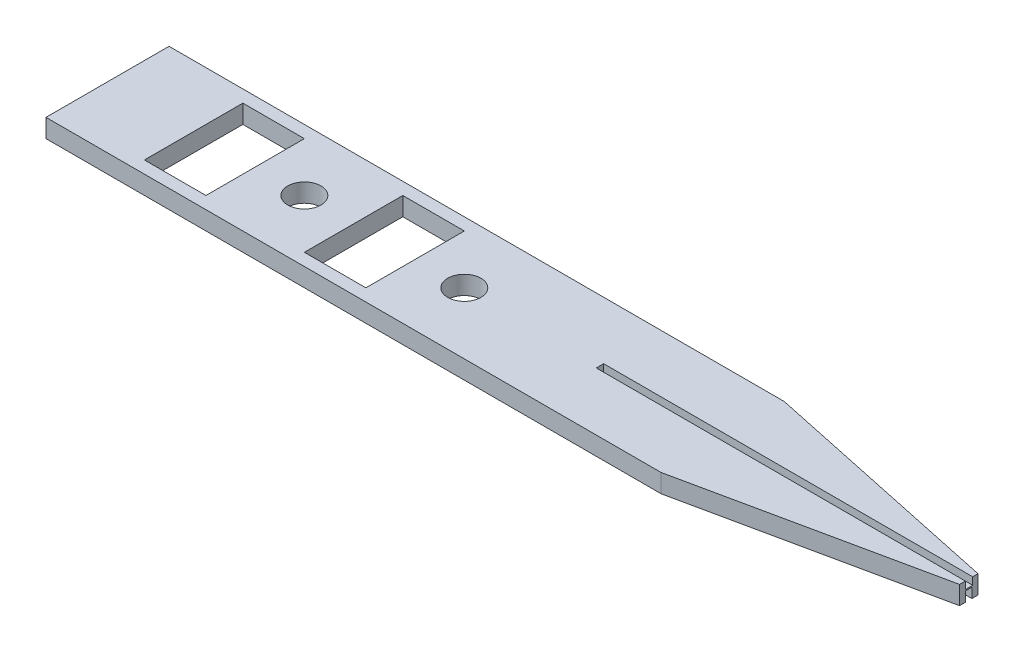
ISO-10303-21;
HEADER;
FILE_DESCRIPTION(('STEP AP214'),'2;1');
FILE_NAME('part.step','',(''),(''),'','','');
FILE_SCHEMA(('AUTOMOTIVE_DESIGN { 1 0 10303 214 1 1 1 1 }'));
ENDSEC;
DATA;
#1=APPLICATION_CONTEXT('core data for automotive mechanical design processes');
#2=APPLICATION_PROTOCOL_DEFINITION('international standard','automotive_design',2000,#1);
#3=PRODUCT_CONTEXT('',#1,'mechanical');
#4=PRODUCT('Part','Part','',(#3));
#5=PRODUCT_RELATED_PRODUCT_CATEGORY('part','',(#4));
#6=PRODUCT_DEFINITION_FORMATION('','',#4);
#7=PRODUCT_DEFINITION_CONTEXT('part definition',#1,'design');
#8=PRODUCT_DEFINITION('design','',#6,#7);
#9=PRODUCT_DEFINITION_SHAPE('','',#8);
#10=(LENGTH_UNIT() NAMED_UNIT(*) SI_UNIT(.MILLI.,.METRE.));
#11=(NAMED_UNIT(*) PLANE_ANGLE_UNIT() SI_UNIT($,.RADIAN.));
#12=(NAMED_UNIT(*) SI_UNIT($,.STERADIAN.) SOLID_ANGLE_UNIT());
#13=UNCERTAINTY_MEASURE_WITH_UNIT(LENGTH_MEASURE(1.E-05),#10,'distance_accuracy_value','');
#14=(GEOMETRIC_REPRESENTATION_CONTEXT(3) GLOBAL_UNCERTAINTY_ASSIGNED_CONTEXT((#13)) GLOBAL_UNIT_ASSIGNED_CONTEXT((#10,
#11,#12)) REPRESENTATION_CONTEXT('',''));
#15=CARTESIAN_POINT('',(0.,0.,0.));
#16=DIRECTION('',(0.,0.,1.));
#17=DIRECTION('',(1.,0.,0.));
#18=AXIS2_PLACEMENT_3D('',#15,#16,#17);
#19=CARTESIAN_POINT('',(31.3961840371878,31.452892525639,46.7205847765638));
#20=DIRECTION('',(-0.207858755820045,0.,-0.978158850917857));
#21=DIRECTION('',(-0.978158850917857,0.,0.207858755820045));
#22=AXIS2_PLACEMENT_3D('',#19,#20,#21);
#23=PLANE('',#22);
#24=DIRECTION('',(0.978158850917857,0.,-0.207858755820045));
#25=VECTOR('',#24,1.);
#26=CARTESIAN_POINT('',(31.3961840371878,29.952892525639,46.7205847765638));
#27=LINE('',#26,#25);
#28=CARTESIAN_POINT('',(31.3961840371878,29.952892525639,46.7205847765638));
#29=VERTEX_POINT('',#28);
#30=CARTESIAN_POINT('',(51.3961840371879,29.952892525639,42.4705847765638));
#31=VERTEX_POINT('',#30);
#32=EDGE_CURVE('E340',#29,#31,#27,.T.);
#33=ORIENTED_EDGE('',*,*,#32,.T.);
#34=DIRECTION('',(0.,-1.,0.));
#35=VECTOR('',#34,1.);
#36=CARTESIAN_POINT('',(51.3961840371879,31.452892525639,42.4705847765638));
#37=LINE('',#36,#35);
#38=CARTESIAN_POINT('',(51.3961840371879,31.452892525639,42.4705847765638));
#39=VERTEX_POINT('',#38);
#40=EDGE_CURVE('E41',#39,#31,#37,.T.);
#41=ORIENTED_EDGE('',*,*,#40,.F.);
#42=DIRECTION('',(0.978158850917857,0.,-0.207858755820045));
#43=VECTOR('',#42,1.);
#44=CARTESIAN_POINT('',(31.3961840371878,31.452892525639,46.7205847765638));
#45=LINE('',#44,#43);
#46=CARTESIAN_POINT('',(31.3961840371878,31.452892525639,46.7205847765638));
#47=VERTEX_POINT('',#46);
#48=EDGE_CURVE('E57',#47,#39,#45,.T.);
#49=ORIENTED_EDGE('',*,*,#48,.F.);
#50=DIRECTION('',(0.,-1.,0.));
#51=VECTOR('',#50,1.);
#52=CARTESIAN_POINT('',(31.3961840371878,31.452892525639,46.7205847765638));
#53=LINE('',#52,#51);
#54=EDGE_CURVE('E77',#47,#29,#53,.T.);
#55=ORIENTED_EDGE('',*,*,#54,.T.);
#56=EDGE_LOOP('',(#33,#41,#49,#55));
#57=FACE_BOUND('',#56,.T.);
#58=ADVANCED_FACE('F34',(#57),#23,.F.);
#59=CARTESIAN_POINT('',(51.3961840371879,31.452892525639,40.9705847765638));
#60=DIRECTION('',(-1.,0.,0.));
#61=DIRECTION('',(0.,0.,1.));
#62=AXIS2_PLACEMENT_3D('',#59,#60,#61);
#63=PLANE('',#62);
#64=DIRECTION('',(0.,0.,1.));
#65=VECTOR('',#64,1.);
#66=CARTESIAN_POINT('',(51.3961840371879,30.752892525639,41.4685201802827));
#67=LINE('',#66,#65);
#68=CARTESIAN_POINT('',(51.3961840371879,30.752892525639,41.4685201802827));
#69=VERTEX_POINT('',#68);
#70=CARTESIAN_POINT('',(51.3961840371879,30.752892525639,41.9670466046952));
#71=VERTEX_POINT('',#70);
#72=EDGE_CURVE('E194',#69,#71,#67,.T.);
#73=ORIENTED_EDGE('',*,*,#72,.F.);
#74=DIRECTION('',(0.,-1.,0.));
#75=VECTOR('',#74,1.);
#76=CARTESIAN_POINT('',(51.3961840371879,30.752892525639,41.4685201802827));
#77=LINE('',#76,#75);
#78=CARTESIAN_POINT('',(51.3961840371879,29.952892525639,41.4685201802827));
#79=VERTEX_POINT('',#78);
#80=EDGE_CURVE('E224',#69,#79,#77,.T.);
#81=ORIENTED_EDGE('',*,*,#80,.T.);
#82=DIRECTION('',(0.,0.,-1.));
#83=VECTOR('',#82,1.);
#84=CARTESIAN_POINT('',(51.3961840371879,29.952892525639,40.9705847765638));
#85=LINE('',#84,#83);
#86=CARTESIAN_POINT('',(51.3961840371879,29.952892525639,40.9705847765638));
#87=VERTEX_POINT('',#86);
#88=EDGE_CURVE('E350',#79,#87,#85,.T.);
#89=ORIENTED_EDGE('',*,*,#88,.T.);
#90=DIRECTION('',(0.,-1.,0.));
#91=VECTOR('',#90,1.);
#92=CARTESIAN_POINT('',(51.3961840371879,31.452892525639,40.9705847765638));
#93=LINE('',#92,#91);
#94=CARTESIAN_POINT('',(51.3961840371879,31.452892525639,40.9705847765638));
#95=VERTEX_POINT('',#94);
#96=EDGE_CURVE('E348',#95,#87,#93,.T.);
#97=ORIENTED_EDGE('',*,*,#96,.F.);
#98=DIRECTION('',(0.,0.,-1.));
#99=VECTOR('',#98,1.);
#100=CARTESIAN_POINT('',(51.3961840371879,31.452892525639,40.9705847765638));
#101=LINE('',#100,#99);
#102=CARTESIAN_POINT('',(51.3961840371879,31.452892525639,41.3991422298061));
#103=VERTEX_POINT('',#102);
#104=EDGE_CURVE('E343',#103,#95,#101,.T.);
#105=ORIENTED_EDGE('',*,*,#104,.F.);
#106=DIRECTION('',(0.,1.,0.));
#107=VECTOR('',#106,1.);
#108=CARTESIAN_POINT('',(51.3961840371879,30.852892525639,41.3991422298061));
#109=LINE('',#108,#107);
#110=CARTESIAN_POINT('',(51.3961840371879,30.852892525639,41.3991422298061));
#111=VERTEX_POINT('',#110);
#112=EDGE_CURVE('E338',#111,#103,#109,.T.);
#113=ORIENTED_EDGE('',*,*,#112,.F.);
#114=DIRECTION('',(0.,0.,-1.));
#115=VECTOR('',#114,1.);
#116=CARTESIAN_POINT('',(51.3961840371879,30.852892525639,41.9991422298061));
#117=LINE('',#116,#115);
#118=CARTESIAN_POINT('',(51.3961840371879,30.852892525639,41.9991422298061));
#119=VERTEX_POINT('',#118);
#120=EDGE_CURVE('E332',#119,#111,#117,.T.);
#121=ORIENTED_EDGE('',*,*,#120,.F.);
#122=DIRECTION('',(0.,1.,0.));
#123=VECTOR('',#122,1.);
#124=CARTESIAN_POINT('',(51.3961840371879,30.852892525639,41.9991422298061));
#125=LINE('',#124,#123);
#126=CARTESIAN_POINT('',(51.3961840371879,31.452892525639,41.9991422298061));
#127=VERTEX_POINT('',#126);
#128=EDGE_CURVE('E336',#119,#127,#125,.T.);
#129=ORIENTED_EDGE('',*,*,#128,.T.);
#130=EDGE_CURVE('E85',#39,#127,#101,.T.);
#131=ORIENTED_EDGE('',*,*,#130,.F.);
#132=ORIENTED_EDGE('',*,*,#40,.T.);
#133=CARTESIAN_POINT('',(51.3961840371879,29.952892525639,41.9670466046952));
#134=VERTEX_POINT('',#133);
#135=EDGE_CURVE('E210',#31,#134,#85,.T.);
#136=ORIENTED_EDGE('',*,*,#135,.T.);
#137=DIRECTION('',(0.,-1.,0.));
#138=VECTOR('',#137,1.);
#139=CARTESIAN_POINT('',(51.3961840371879,30.752892525639,41.9670466046952));
#140=LINE('',#139,#138);
#141=EDGE_CURVE('E48',#71,#134,#140,.T.);
#142=ORIENTED_EDGE('',*,*,#141,.F.);
#143=EDGE_LOOP('',(#73,#81,#89,#97,#105,#113,#121,#129,#131,#132,#136,#142));
#144=FACE_BOUND('',#143,.T.);
#145=ADVANCED_FACE('F209',(#144),#63,.F.);
#146=CARTESIAN_POINT('',(51.3961840371879,31.452892525639,40.9705847765638));
#147=DIRECTION('',(-0.207858755820045,0.,0.978158850917857));
#148=DIRECTION('',(0.978158850917857,0.,0.207858755820045));
#149=AXIS2_PLACEMENT_3D('',#146,#147,#148);
#150=PLANE('',#149);
#151=DIRECTION('',(-0.978158850917857,0.,-0.207858755820045));
#152=VECTOR('',#151,1.);
#153=CARTESIAN_POINT('',(51.3961840371879,29.952892525639,40.9705847765638));
#154=LINE('',#153,#152);
#155=CARTESIAN_POINT('',(31.3961840371878,29.952892525639,36.7205847765638));
#156=VERTEX_POINT('',#155);
#157=EDGE_CURVE('E344',#87,#156,#154,.T.);
#158=ORIENTED_EDGE('',*,*,#157,.T.);
#159=DIRECTION('',(0.,-1.,0.));
#160=VECTOR('',#159,1.);
#161=CARTESIAN_POINT('',(31.3961840371878,31.452892525639,36.7205847765638));
#162=LINE('',#161,#160);
#163=CARTESIAN_POINT('',(31.3961840371878,31.452892525639,36.7205847765638));
#164=VERTEX_POINT('',#163);
#165=EDGE_CURVE('E298',#164,#156,#162,.T.);
#166=ORIENTED_EDGE('',*,*,#165,.F.);
#167=DIRECTION('',(-0.978158850917857,0.,-0.207858755820045));
#168=VECTOR('',#167,1.);
#169=CARTESIAN_POINT('',(51.3961840371879,31.452892525639,40.9705847765638));
#170=LINE('',#169,#168);
#171=EDGE_CURVE('E346',#95,#164,#170,.T.);
#172=ORIENTED_EDGE('',*,*,#171,.F.);
#173=ORIENTED_EDGE('',*,*,#96,.T.);
#174=EDGE_LOOP('',(#158,#166,#172,#173));
#175=FACE_BOUND('',#174,.T.);
#176=ADVANCED_FACE('F377',(#175),#150,.F.);
#177=CARTESIAN_POINT('',(31.3961840371878,31.452892525639,41.7205847765638));
#178=DIRECTION('',(0.,-1.,0.));
#179=DIRECTION('',(0.,0.,-1.));
#180=AXIS2_PLACEMENT_3D('',#177,#178,#179);
#181=PLANE('',#180);
#182=ORIENTED_EDGE('',*,*,#130,.T.);
#183=DIRECTION('',(-1.,0.,0.));
#184=VECTOR('',#183,1.);
#185=CARTESIAN_POINT('',(31.3961840371878,31.452892525639,41.9991422298061));
#186=LINE('',#185,#184);
#187=CARTESIAN_POINT('',(21.3961840371878,31.452892525639,41.9991422298061));
#188=VERTEX_POINT('',#187);
#189=EDGE_CURVE('E11',#127,#188,#186,.T.);
#190=ORIENTED_EDGE('',*,*,#189,.T.);
#191=DIRECTION('',(0.,0.,1.));
#192=VECTOR('',#191,1.);
#193=CARTESIAN_POINT('',(21.3961840371878,31.452892525639,41.3991422298061));
#194=LINE('',#193,#192);
#195=CARTESIAN_POINT('',(21.3961840371878,31.452892525639,41.3991422298061));
#196=VERTEX_POINT('',#195);
#197=EDGE_CURVE('E221',#196,#188,#194,.T.);
#198=ORIENTED_EDGE('',*,*,#197,.F.);
#199=DIRECTION('',(-1.,0.,0.));
#200=VECTOR('',#199,1.);
#201=CARTESIAN_POINT('',(51.3961840371879,31.452892525639,41.3991422298061));
#202=LINE('',#201,#200);
#203=EDGE_CURVE('E327',#103,#196,#202,.T.);
#204=ORIENTED_EDGE('',*,*,#203,.F.);
#205=ORIENTED_EDGE('',*,*,#104,.T.);
#206=ORIENTED_EDGE('',*,*,#171,.T.);
#207=DIRECTION('',(-1.,0.,0.));
#208=VECTOR('',#207,1.);
#209=CARTESIAN_POINT('',(-18.6038159628122,31.452892525639,36.7205847765638));
#210=LINE('',#209,#208);
#211=CARTESIAN_POINT('',(-18.6038159628122,31.452892525639,36.7205847765638));
#212=VERTEX_POINT('',#211);
#213=EDGE_CURVE('E279',#164,#212,#210,.T.);
#214=ORIENTED_EDGE('',*,*,#213,.T.);
#215=DIRECTION('',(0.,0.,1.));
#216=VECTOR('',#215,1.);
#217=CARTESIAN_POINT('',(-18.6038159628122,31.452892525639,36.7205847765638));
#218=LINE('',#217,#216);
#219=CARTESIAN_POINT('',(-18.6038159628122,31.452892525639,46.7205847765638));
#220=VERTEX_POINT('',#219);
#221=EDGE_CURVE('E281',#212,#220,#218,.T.);
#222=ORIENTED_EDGE('',*,*,#221,.T.);
#223=DIRECTION('',(1.,0.,0.));
#224=VECTOR('',#223,1.);
#225=CARTESIAN_POINT('',(-18.6038159628122,31.452892525639,46.7205847765638));
#226=LINE('',#225,#224);
#227=EDGE_CURVE('E284',#220,#47,#226,.T.);
#228=ORIENTED_EDGE('',*,*,#227,.T.);
#229=ORIENTED_EDGE('',*,*,#48,.T.);
#230=EDGE_LOOP('',(#182,#190,#198,#204,#205,#206,#214,#222,#228,#229));
#231=FACE_BOUND('',#230,.T.);
#232=CARTESIAN_POINT('',(10.3961840371879,31.452892525639,41.7205847765638));
#233=DIRECTION('',(0.,1.,0.));
#234=DIRECTION('',(0.,0.,1.));
#235=AXIS2_PLACEMENT_3D('',#232,#233,#234);
#236=CIRCLE('',#235,1.35);
#237=CARTESIAN_POINT('',(10.3961840371879,31.452892525639,43.0705847765638));
#238=VERTEX_POINT('',#237);
#239=EDGE_CURVE('E228',#238,#238,#236,.T.);
#240=ORIENTED_EDGE('',*,*,#239,.F.);
#241=EDGE_LOOP('',(#240));
#242=FACE_BOUND('',#241,.T.);
#243=DIRECTION('',(1.,0.,0.));
#244=VECTOR('',#243,1.);
#245=CARTESIAN_POINT('',(1.39618403718784,31.452892525639,45.7205847765638));
#246=LINE('',#245,#244);
#247=CARTESIAN_POINT('',(1.39618403718784,31.452892525639,45.7205847765638));
#248=VERTEX_POINT('',#247);
#249=CARTESIAN_POINT('',(6.39618403718784,31.452892525639,45.7205847765638));
#250=VERTEX_POINT('',#249);
#251=EDGE_CURVE('E234',#248,#250,#246,.T.);
#252=ORIENTED_EDGE('',*,*,#251,.F.);
#253=DIRECTION('',(0.,0.,1.));
#254=VECTOR('',#253,1.);
#255=CARTESIAN_POINT('',(1.39618403718784,31.452892525639,37.7205847765638));
#256=LINE('',#255,#254);
#257=CARTESIAN_POINT('',(1.39618403718784,31.452892525639,37.7205847765638));
#258=VERTEX_POINT('',#257);
#259=EDGE_CURVE('E242',#258,#248,#256,.T.);
#260=ORIENTED_EDGE('',*,*,#259,.F.);
#261=DIRECTION('',(-1.,0.,0.));
#262=VECTOR('',#261,1.);
#263=CARTESIAN_POINT('',(1.39618403718784,31.452892525639,37.7205847765638));
#264=LINE('',#263,#262);
#265=CARTESIAN_POINT('',(6.39618403718784,31.452892525639,37.7205847765638));
#266=VERTEX_POINT('',#265);
#267=EDGE_CURVE('E239',#266,#258,#264,.T.);
#268=ORIENTED_EDGE('',*,*,#267,.F.);
#269=DIRECTION('',(0.,0.,-1.));
#270=VECTOR('',#269,1.);
#271=CARTESIAN_POINT('',(6.39618403718784,31.452892525639,45.7205847765638));
#272=LINE('',#271,#270);
#273=EDGE_CURVE('E236',#250,#266,#272,.T.);
#274=ORIENTED_EDGE('',*,*,#273,.F.);
#275=EDGE_LOOP('',(#252,#260,#268,#274));
#276=FACE_BOUND('',#275,.T.);
#277=CARTESIAN_POINT('',(-2.60381596281216,31.452892525639,41.7205847765638));
#278=DIRECTION('',(0.,1.,0.));
#279=DIRECTION('',(0.,0.,1.));
#280=AXIS2_PLACEMENT_3D('',#277,#278,#279);
#281=CIRCLE('',#280,1.35);
#282=CARTESIAN_POINT('',(-2.60381596281216,31.452892525639,43.0705847765638));
#283=VERTEX_POINT('',#282);
#284=EDGE_CURVE('E248',#283,#283,#281,.T.);
#285=ORIENTED_EDGE('',*,*,#284,.F.);
#286=EDGE_LOOP('',(#285));
#287=FACE_BOUND('',#286,.T.);
#288=DIRECTION('',(1.,0.,0.));
#289=VECTOR('',#288,1.);
#290=CARTESIAN_POINT('',(-11.6038159628122,31.452892525639,45.7205847765638));
#291=LINE('',#290,#289);
#292=CARTESIAN_POINT('',(-11.6038159628122,31.452892525639,45.7205847765638));
#293=VERTEX_POINT('',#292);
#294=CARTESIAN_POINT('',(-6.60381596281216,31.452892525639,45.7205847765638));
#295=VERTEX_POINT('',#294);
#296=EDGE_CURVE('E258',#293,#295,#291,.T.);
#297=ORIENTED_EDGE('',*,*,#296,.F.);
#298=DIRECTION('',(0.,0.,1.));
#299=VECTOR('',#298,1.);
#300=CARTESIAN_POINT('',(-11.6038159628122,31.452892525639,37.7205847765638));
#301=LINE('',#300,#299);
#302=CARTESIAN_POINT('',(-11.6038159628122,31.452892525639,37.7205847765638));
#303=VERTEX_POINT('',#302);
#304=EDGE_CURVE('E266',#303,#293,#301,.T.);
#305=ORIENTED_EDGE('',*,*,#304,.F.);
#306=DIRECTION('',(-1.,0.,0.));
#307=VECTOR('',#306,1.);
#308=CARTESIAN_POINT('',(-11.6038159628122,31.452892525639,37.7205847765638));
#309=LINE('',#308,#307);
#310=CARTESIAN_POINT('',(-6.60381596281216,31.452892525639,37.7205847765638));
#311=VERTEX_POINT('',#310);
#312=EDGE_CURVE('E263',#311,#303,#309,.T.);
#313=ORIENTED_EDGE('',*,*,#312,.F.);
#314=DIRECTION('',(0.,0.,-1.));
#315=VECTOR('',#314,1.);
#316=CARTESIAN_POINT('',(-6.60381596281216,31.452892525639,45.7205847765638));
#317=LINE('',#316,#315);
#318=EDGE_CURVE('E260',#295,#311,#317,.T.);
#319=ORIENTED_EDGE('',*,*,#318,.F.);
#320=EDGE_LOOP('',(#297,#305,#313,#319));
#321=FACE_BOUND('',#320,.T.);
#322=ADVANCED_FACE('F410',(#231,#242,#276,#287,#321),#181,.F.);
#323=CARTESIAN_POINT('',(31.3961840371878,29.952892525639,41.7205847765638));
#324=DIRECTION('',(0.,-1.,0.));
#325=DIRECTION('',(0.,0.,-1.));
#326=AXIS2_PLACEMENT_3D('',#323,#324,#325);
#327=PLANE('',#326);
#328=DIRECTION('',(1.,0.,0.));
#329=VECTOR('',#328,1.);
#330=CARTESIAN_POINT('',(21.3914120809828,29.952892525639,41.4685201802827));
#331=LINE('',#330,#329);
#332=CARTESIAN_POINT('',(21.3914120809828,29.952892525639,41.4685201802827));
#333=VERTEX_POINT('',#332);
#334=EDGE_CURVE('E201',#333,#79,#331,.T.);
#335=ORIENTED_EDGE('',*,*,#334,.F.);
#336=DIRECTION('',(0.,0.,-1.));
#337=VECTOR('',#336,1.);
#338=CARTESIAN_POINT('',(21.3914120809828,29.952892525639,41.9670466046952));
#339=LINE('',#338,#337);
#340=CARTESIAN_POINT('',(21.3914120809828,29.952892525639,41.9670466046952));
#341=VERTEX_POINT('',#340);
#342=EDGE_CURVE('E383',#341,#333,#339,.T.);
#343=ORIENTED_EDGE('',*,*,#342,.F.);
#344=DIRECTION('',(-1.,0.,0.));
#345=VECTOR('',#344,1.);
#346=CARTESIAN_POINT('',(51.3961840371879,29.952892525639,41.9670466046952));
#347=LINE('',#346,#345);
#348=EDGE_CURVE('E386',#134,#341,#347,.T.);
#349=ORIENTED_EDGE('',*,*,#348,.F.);
#350=ORIENTED_EDGE('',*,*,#135,.F.);
#351=ORIENTED_EDGE('',*,*,#32,.F.);
#352=DIRECTION('',(1.,0.,0.));
#353=VECTOR('',#352,1.);
#354=CARTESIAN_POINT('',(-18.6038159628122,29.952892525639,46.7205847765638));
#355=LINE('',#354,#353);
#356=CARTESIAN_POINT('',(-18.6038159628122,29.952892525639,46.7205847765638));
#357=VERTEX_POINT('',#356);
#358=EDGE_CURVE('E282',#357,#29,#355,.T.);
#359=ORIENTED_EDGE('',*,*,#358,.F.);
#360=DIRECTION('',(0.,0.,1.));
#361=VECTOR('',#360,1.);
#362=CARTESIAN_POINT('',(-18.6038159628122,29.952892525639,36.7205847765638));
#363=LINE('',#362,#361);
#364=CARTESIAN_POINT('',(-18.6038159628122,29.952892525639,36.7205847765638));
#365=VERTEX_POINT('',#364);
#366=EDGE_CURVE('E287',#365,#357,#363,.T.);
#367=ORIENTED_EDGE('',*,*,#366,.F.);
#368=DIRECTION('',(-1.,0.,0.));
#369=VECTOR('',#368,1.);
#370=CARTESIAN_POINT('',(-18.6038159628122,29.952892525639,36.7205847765638));
#371=LINE('',#370,#369);
#372=EDGE_CURVE('E272',#156,#365,#371,.T.);
#373=ORIENTED_EDGE('',*,*,#372,.F.);
#374=ORIENTED_EDGE('',*,*,#157,.F.);
#375=ORIENTED_EDGE('',*,*,#88,.F.);
#376=EDGE_LOOP('',(#335,#343,#349,#350,#351,#359,#367,#373,#374,#375));
#377=FACE_BOUND('',#376,.T.);
#378=CARTESIAN_POINT('',(10.3961840371879,29.952892525639,41.7205847765638));
#379=DIRECTION('',(0.,1.,0.));
#380=DIRECTION('',(0.,0.,1.));
#381=AXIS2_PLACEMENT_3D('',#378,#379,#380);
#382=CIRCLE('',#381,1.35);
#383=CARTESIAN_POINT('',(10.3961840371879,29.952892525639,43.0705847765638));
#384=VERTEX_POINT('',#383);
#385=EDGE_CURVE('E233',#384,#384,#382,.T.);
#386=ORIENTED_EDGE('',*,*,#385,.T.);
#387=EDGE_LOOP('',(#386));
#388=FACE_BOUND('',#387,.T.);
#389=DIRECTION('',(0.,0.,1.));
#390=VECTOR('',#389,1.);
#391=CARTESIAN_POINT('',(1.39618403718784,29.952892525639,41.7205847765638));
#392=LINE('',#391,#390);
#393=CARTESIAN_POINT('',(1.39618403718784,29.952892525639,37.7205847765638));
#394=VERTEX_POINT('',#393);
#395=CARTESIAN_POINT('',(1.39618403718784,29.952892525639,45.7205847765638));
#396=VERTEX_POINT('',#395);
#397=EDGE_CURVE('E321',#394,#396,#392,.T.);
#398=ORIENTED_EDGE('',*,*,#397,.T.);
#399=DIRECTION('',(1.,0.,0.));
#400=VECTOR('',#399,1.);
#401=CARTESIAN_POINT('',(6.39618403718786,29.952892525639,45.7205847765638));
#402=LINE('',#401,#400);
#403=CARTESIAN_POINT('',(6.39618403718784,29.952892525639,45.7205847765638));
#404=VERTEX_POINT('',#403);
#405=EDGE_CURVE('E324',#396,#404,#402,.T.);
#406=ORIENTED_EDGE('',*,*,#405,.T.);
#407=DIRECTION('',(0.,0.,-1.));
#408=VECTOR('',#407,1.);
#409=CARTESIAN_POINT('',(6.39618403718784,29.952892525639,41.7205847765638));
#410=LINE('',#409,#408);
#411=CARTESIAN_POINT('',(6.39618403718784,29.952892525639,37.7205847765638));
#412=VERTEX_POINT('',#411);
#413=EDGE_CURVE('E313',#404,#412,#410,.T.);
#414=ORIENTED_EDGE('',*,*,#413,.T.);
#415=DIRECTION('',(-1.,0.,0.));
#416=VECTOR('',#415,1.);
#417=CARTESIAN_POINT('',(6.39618403718786,29.952892525639,37.7205847765638));
#418=LINE('',#417,#416);
#419=EDGE_CURVE('E318',#412,#394,#418,.T.);
#420=ORIENTED_EDGE('',*,*,#419,.T.);
#421=EDGE_LOOP('',(#398,#406,#414,#420));
#422=FACE_BOUND('',#421,.T.);
#423=CARTESIAN_POINT('',(-2.60381596281216,29.952892525639,41.7205847765638));
#424=DIRECTION('',(0.,1.,0.));
#425=DIRECTION('',(0.,0.,1.));
#426=AXIS2_PLACEMENT_3D('',#423,#424,#425);
#427=CIRCLE('',#426,1.35);
#428=CARTESIAN_POINT('',(-2.60381596281216,29.952892525639,43.0705847765638));
#429=VERTEX_POINT('',#428);
#430=EDGE_CURVE('E257',#429,#429,#427,.T.);
#431=ORIENTED_EDGE('',*,*,#430,.T.);
#432=EDGE_LOOP('',(#431));
#433=FACE_BOUND('',#432,.T.);
#434=DIRECTION('',(0.,0.,1.));
#435=VECTOR('',#434,1.);
#436=CARTESIAN_POINT('',(-11.6038159628122,29.952892525639,41.7205847765638));
#437=LINE('',#436,#435);
#438=CARTESIAN_POINT('',(-11.6038159628122,29.952892525639,37.7205847765638));
#439=VERTEX_POINT('',#438);
#440=CARTESIAN_POINT('',(-11.6038159628122,29.952892525639,45.7205847765638));
#441=VERTEX_POINT('',#440);
#442=EDGE_CURVE('E307',#439,#441,#437,.T.);
#443=ORIENTED_EDGE('',*,*,#442,.T.);
#444=DIRECTION('',(1.,0.,0.));
#445=VECTOR('',#444,1.);
#446=CARTESIAN_POINT('',(6.39618403718786,29.952892525639,45.7205847765638));
#447=LINE('',#446,#445);
#448=CARTESIAN_POINT('',(-6.60381596281216,29.952892525639,45.7205847765638));
#449=VERTEX_POINT('',#448);
#450=EDGE_CURVE('E310',#441,#449,#447,.T.);
#451=ORIENTED_EDGE('',*,*,#450,.T.);
#452=DIRECTION('',(0.,0.,-1.));
#453=VECTOR('',#452,1.);
#454=CARTESIAN_POINT('',(-6.60381596281216,29.952892525639,41.7205847765638));
#455=LINE('',#454,#453);
#456=CARTESIAN_POINT('',(-6.60381596281216,29.952892525639,37.7205847765638));
#457=VERTEX_POINT('',#456);
#458=EDGE_CURVE('E301',#449,#457,#455,.T.);
#459=ORIENTED_EDGE('',*,*,#458,.T.);
#460=DIRECTION('',(-1.,0.,0.));
#461=VECTOR('',#460,1.);
#462=CARTESIAN_POINT('',(6.39618403718786,29.952892525639,37.7205847765638));
#463=LINE('',#462,#461);
#464=EDGE_CURVE('E304',#457,#439,#463,.T.);
#465=ORIENTED_EDGE('',*,*,#464,.T.);
#466=EDGE_LOOP('',(#443,#451,#459,#465));
#467=FACE_BOUND('',#466,.T.);
#468=ADVANCED_FACE('F357',(#377,#388,#422,#433,#467),#327,.T.);
#469=CARTESIAN_POINT('',(0.,30.852892525639,0.));
#470=DIRECTION('',(0.,-1.,0.));
#471=DIRECTION('',(0.,0.,-1.));
#472=AXIS2_PLACEMENT_3D('',#469,#470,#471);
#473=PLANE('',#472);
#474=DIRECTION('',(1.,0.,0.));
#475=VECTOR('',#474,1.);
#476=CARTESIAN_POINT('',(51.3961840371879,30.852892525639,41.9991422298061));
#477=LINE('',#476,#475);
#478=CARTESIAN_POINT('',(21.3961840371878,30.852892525639,41.9991422298061));
#479=VERTEX_POINT('',#478);
#480=EDGE_CURVE('E330',#479,#119,#477,.T.);
#481=ORIENTED_EDGE('',*,*,#480,.T.);
#482=ORIENTED_EDGE('',*,*,#120,.T.);
#483=DIRECTION('',(-1.,0.,0.));
#484=VECTOR('',#483,1.);
#485=CARTESIAN_POINT('',(51.3961840371879,30.852892525639,41.3991422298061));
#486=LINE('',#485,#484);
#487=CARTESIAN_POINT('',(21.3961840371878,30.852892525639,41.3991422298061));
#488=VERTEX_POINT('',#487);
#489=EDGE_CURVE('E334',#111,#488,#486,.T.);
#490=ORIENTED_EDGE('',*,*,#489,.T.);
#491=DIRECTION('',(0.,0.,1.));
#492=VECTOR('',#491,1.);
#493=CARTESIAN_POINT('',(21.3961840371878,30.852892525639,41.3991422298061));
#494=LINE('',#493,#492);
#495=EDGE_CURVE('E217',#488,#479,#494,.T.);
#496=ORIENTED_EDGE('',*,*,#495,.T.);
#497=EDGE_LOOP('',(#481,#482,#490,#496));
#498=FACE_BOUND('',#497,.T.);
#499=ADVANCED_FACE('F415',(#498),#473,.F.);
#500=CARTESIAN_POINT('',(51.3961840371879,30.852892525639,41.3991422298061));
#501=DIRECTION('',(0.,0.,-1.));
#502=DIRECTION('',(-1.,0.,0.));
#503=AXIS2_PLACEMENT_3D('',#500,#501,#502);
#504=PLANE('',#503);
#505=ORIENTED_EDGE('',*,*,#489,.F.);
#506=ORIENTED_EDGE('',*,*,#112,.T.);
#507=ORIENTED_EDGE('',*,*,#203,.T.);
#508=DIRECTION('',(0.,1.,0.));
#509=VECTOR('',#508,1.);
#510=CARTESIAN_POINT('',(21.3961840371878,30.852892525639,41.3991422298061));
#511=LINE('',#510,#509);
#512=EDGE_CURVE('E225',#488,#196,#511,.T.);
#513=ORIENTED_EDGE('',*,*,#512,.F.);
#514=EDGE_LOOP('',(#505,#506,#507,#513));
#515=FACE_BOUND('',#514,.T.);
#516=ADVANCED_FACE('F422',(#515),#504,.F.);
#517=CARTESIAN_POINT('',(51.3961840371879,30.852892525639,41.9991422298061));
#518=DIRECTION('',(0.,0.,1.));
#519=DIRECTION('',(1.,0.,0.));
#520=AXIS2_PLACEMENT_3D('',#517,#518,#519);
#521=PLANE('',#520);
#522=ORIENTED_EDGE('',*,*,#189,.F.);
#523=ORIENTED_EDGE('',*,*,#128,.F.);
#524=ORIENTED_EDGE('',*,*,#480,.F.);
#525=DIRECTION('',(0.,1.,0.));
#526=VECTOR('',#525,1.);
#527=CARTESIAN_POINT('',(21.3961840371878,30.852892525639,41.9991422298061));
#528=LINE('',#527,#526);
#529=EDGE_CURVE('E220',#479,#188,#528,.T.);
#530=ORIENTED_EDGE('',*,*,#529,.T.);
#531=EDGE_LOOP('',(#522,#523,#524,#530));
#532=FACE_BOUND('',#531,.T.);
#533=ADVANCED_FACE('F419',(#532),#521,.F.);
#534=CARTESIAN_POINT('',(-18.6038159628122,31.452892525639,36.7205847765638));
#535=DIRECTION('',(0.,0.,1.));
#536=DIRECTION('',(1.,0.,0.));
#537=AXIS2_PLACEMENT_3D('',#534,#535,#536);
#538=PLANE('',#537);
#539=ORIENTED_EDGE('',*,*,#372,.T.);
#540=DIRECTION('',(0.,-1.,0.));
#541=VECTOR('',#540,1.);
#542=CARTESIAN_POINT('',(-18.6038159628122,31.452892525639,36.7205847765638));
#543=LINE('',#542,#541);
#544=EDGE_CURVE('E295',#212,#365,#543,.T.);
#545=ORIENTED_EDGE('',*,*,#544,.F.);
#546=ORIENTED_EDGE('',*,*,#213,.F.);
#547=ORIENTED_EDGE('',*,*,#165,.T.);
#548=EDGE_LOOP('',(#539,#545,#546,#547));
#549=FACE_BOUND('',#548,.T.);
#550=ADVANCED_FACE('F374',(#549),#538,.F.);
#551=CARTESIAN_POINT('',(-18.6038159628122,31.452892525639,36.7205847765638));
#552=DIRECTION('',(1.,0.,0.));
#553=DIRECTION('',(0.,0.,-1.));
#554=AXIS2_PLACEMENT_3D('',#551,#552,#553);
#555=PLANE('',#554);
#556=ORIENTED_EDGE('',*,*,#366,.T.);
#557=DIRECTION('',(0.,-1.,0.));
#558=VECTOR('',#557,1.);
#559=CARTESIAN_POINT('',(-18.6038159628122,31.452892525639,46.7205847765638));
#560=LINE('',#559,#558);
#561=EDGE_CURVE('E292',#220,#357,#560,.T.);
#562=ORIENTED_EDGE('',*,*,#561,.F.);
#563=ORIENTED_EDGE('',*,*,#221,.F.);
#564=ORIENTED_EDGE('',*,*,#544,.T.);
#565=EDGE_LOOP('',(#556,#562,#563,#564));
#566=FACE_BOUND('',#565,.T.);
#567=ADVANCED_FACE('F366',(#566),#555,.F.);
#568=CARTESIAN_POINT('',(-18.6038159628122,31.452892525639,46.7205847765638));
#569=DIRECTION('',(0.,0.,-1.));
#570=DIRECTION('',(-1.,0.,0.));
#571=AXIS2_PLACEMENT_3D('',#568,#569,#570);
#572=PLANE('',#571);
#573=ORIENTED_EDGE('',*,*,#358,.T.);
#574=ORIENTED_EDGE('',*,*,#54,.F.);
#575=ORIENTED_EDGE('',*,*,#227,.F.);
#576=ORIENTED_EDGE('',*,*,#561,.T.);
#577=EDGE_LOOP('',(#573,#574,#575,#576));
#578=FACE_BOUND('',#577,.T.);
#579=ADVANCED_FACE('F361',(#578),#572,.F.);
#580=CARTESIAN_POINT('',(-11.6038159628122,29.452892525639,45.7205847765638));
#581=DIRECTION('',(0.,0.,1.));
#582=DIRECTION('',(1.,0.,0.));
#583=AXIS2_PLACEMENT_3D('',#580,#581,#582);
#584=PLANE('',#583);
#585=DIRECTION('',(0.,1.,0.));
#586=VECTOR('',#585,1.);
#587=CARTESIAN_POINT('',(-11.6038159628122,29.452892525639,45.7205847765638));
#588=LINE('',#587,#586);
#589=EDGE_CURVE('E270',#441,#293,#588,.T.);
#590=ORIENTED_EDGE('',*,*,#589,.T.);
#591=ORIENTED_EDGE('',*,*,#296,.T.);
#592=DIRECTION('',(0.,1.,0.));
#593=VECTOR('',#592,1.);
#594=CARTESIAN_POINT('',(-6.60381596281216,29.452892525639,45.7205847765638));
#595=LINE('',#594,#593);
#596=EDGE_CURVE('E269',#449,#295,#595,.T.);
#597=ORIENTED_EDGE('',*,*,#596,.F.);
#598=ORIENTED_EDGE('',*,*,#450,.F.);
#599=EDGE_LOOP('',(#590,#591,#597,#598));
#600=FACE_BOUND('',#599,.T.);
#601=ADVANCED_FACE('F436',(#600),#584,.F.);
#602=CARTESIAN_POINT('',(-11.6038159628122,29.452892525639,37.7205847765638));
#603=DIRECTION('',(-1.,0.,0.));
#604=DIRECTION('',(0.,0.,1.));
#605=AXIS2_PLACEMENT_3D('',#602,#603,#604);
#606=PLANE('',#605);
#607=DIRECTION('',(0.,1.,0.));
#608=VECTOR('',#607,1.);
#609=CARTESIAN_POINT('',(-11.6038159628122,29.452892525639,37.7205847765638));
#610=LINE('',#609,#608);
#611=EDGE_CURVE('E273',#439,#303,#610,.T.);
#612=ORIENTED_EDGE('',*,*,#611,.T.);
#613=ORIENTED_EDGE('',*,*,#304,.T.);
#614=ORIENTED_EDGE('',*,*,#589,.F.);
#615=ORIENTED_EDGE('',*,*,#442,.F.);
#616=EDGE_LOOP('',(#612,#613,#614,#615));
#617=FACE_BOUND('',#616,.T.);
#618=ADVANCED_FACE('F439',(#617),#606,.F.);
#619=CARTESIAN_POINT('',(-11.6038159628122,29.452892525639,37.7205847765638));
#620=DIRECTION('',(0.,0.,-1.));
#621=DIRECTION('',(-1.,0.,0.));
#622=AXIS2_PLACEMENT_3D('',#619,#620,#621);
#623=PLANE('',#622);
#624=DIRECTION('',(0.,1.,0.));
#625=VECTOR('',#624,1.);
#626=CARTESIAN_POINT('',(-6.60381596281216,29.452892525639,37.7205847765638));
#627=LINE('',#626,#625);
#628=EDGE_CURVE('E275',#457,#311,#627,.T.);
#629=ORIENTED_EDGE('',*,*,#628,.T.);
#630=ORIENTED_EDGE('',*,*,#312,.T.);
#631=ORIENTED_EDGE('',*,*,#611,.F.);
#632=ORIENTED_EDGE('',*,*,#464,.F.);
#633=EDGE_LOOP('',(#629,#630,#631,#632));
#634=FACE_BOUND('',#633,.T.);
#635=ADVANCED_FACE('F445',(#634),#623,.F.);
#636=CARTESIAN_POINT('',(-6.60381596281216,29.452892525639,45.7205847765638));
#637=DIRECTION('',(1.,0.,0.));
#638=DIRECTION('',(0.,0.,-1.));
#639=AXIS2_PLACEMENT_3D('',#636,#637,#638);
#640=PLANE('',#639);
#641=ORIENTED_EDGE('',*,*,#596,.T.);
#642=ORIENTED_EDGE('',*,*,#318,.T.);
#643=ORIENTED_EDGE('',*,*,#628,.F.);
#644=ORIENTED_EDGE('',*,*,#458,.F.);
#645=EDGE_LOOP('',(#641,#642,#643,#644));
#646=FACE_BOUND('',#645,.T.);
#647=ADVANCED_FACE('F441',(#646),#640,.F.);
#648=CARTESIAN_POINT('',(-2.60381596281216,29.452892525639,41.7205847765638));
#649=DIRECTION('',(0.,1.,0.));
#650=DIRECTION('',(0.,0.,1.));
#651=AXIS2_PLACEMENT_3D('',#648,#649,#650);
#652=CYLINDRICAL_SURFACE('',#651,1.35);
#653=ORIENTED_EDGE('',*,*,#284,.T.);
#654=EDGE_LOOP('',(#653));
#655=FACE_BOUND('',#654,.T.);
#656=ORIENTED_EDGE('',*,*,#430,.F.);
#657=EDGE_LOOP('',(#656));
#658=FACE_BOUND('',#657,.T.);
#659=ADVANCED_FACE('F444',(#655,#658),#652,.F.);
#660=CARTESIAN_POINT('',(1.39618403718784,29.452892525639,45.7205847765638));
#661=DIRECTION('',(0.,0.,1.));
#662=DIRECTION('',(1.,0.,0.));
#663=AXIS2_PLACEMENT_3D('',#660,#661,#662);
#664=PLANE('',#663);
#665=DIRECTION('',(0.,1.,0.));
#666=VECTOR('',#665,1.);
#667=CARTESIAN_POINT('',(1.39618403718784,29.452892525639,45.7205847765638));
#668=LINE('',#667,#666);
#669=EDGE_CURVE('E246',#396,#248,#668,.T.);
#670=ORIENTED_EDGE('',*,*,#669,.T.);
#671=ORIENTED_EDGE('',*,*,#251,.T.);
#672=DIRECTION('',(0.,1.,0.));
#673=VECTOR('',#672,1.);
#674=CARTESIAN_POINT('',(6.39618403718784,29.452892525639,45.7205847765638));
#675=LINE('',#674,#673);
#676=EDGE_CURVE('E245',#404,#250,#675,.T.);
#677=ORIENTED_EDGE('',*,*,#676,.F.);
#678=ORIENTED_EDGE('',*,*,#405,.F.);
#679=EDGE_LOOP('',(#670,#671,#677,#678));
#680=FACE_BOUND('',#679,.T.);
#681=ADVANCED_FACE('F455',(#680),#664,.F.);
#682=CARTESIAN_POINT('',(1.39618403718784,29.452892525639,37.7205847765638));
#683=DIRECTION('',(-1.,0.,0.));
#684=DIRECTION('',(0.,0.,1.));
#685=AXIS2_PLACEMENT_3D('',#682,#683,#684);
#686=PLANE('',#685);
#687=DIRECTION('',(0.,1.,0.));
#688=VECTOR('',#687,1.);
#689=CARTESIAN_POINT('',(1.39618403718784,29.452892525639,37.7205847765638));
#690=LINE('',#689,#688);
#691=EDGE_CURVE('E249',#394,#258,#690,.T.);
#692=ORIENTED_EDGE('',*,*,#691,.T.);
#693=ORIENTED_EDGE('',*,*,#259,.T.);
#694=ORIENTED_EDGE('',*,*,#669,.F.);
#695=ORIENTED_EDGE('',*,*,#397,.F.);
#696=EDGE_LOOP('',(#692,#693,#694,#695));
#697=FACE_BOUND('',#696,.T.);
#698=ADVANCED_FACE('F459',(#697),#686,.F.);
#699=CARTESIAN_POINT('',(1.39618403718784,29.452892525639,37.7205847765638));
#700=DIRECTION('',(0.,0.,-1.));
#701=DIRECTION('',(-1.,0.,0.));
#702=AXIS2_PLACEMENT_3D('',#699,#700,#701);
#703=PLANE('',#702);
#704=DIRECTION('',(0.,1.,0.));
#705=VECTOR('',#704,1.);
#706=CARTESIAN_POINT('',(6.39618403718784,29.452892525639,37.7205847765638));
#707=LINE('',#706,#705);
#708=EDGE_CURVE('E251',#412,#266,#707,.T.);
#709=ORIENTED_EDGE('',*,*,#708,.T.);
#710=ORIENTED_EDGE('',*,*,#267,.T.);
#711=ORIENTED_EDGE('',*,*,#691,.F.);
#712=ORIENTED_EDGE('',*,*,#419,.F.);
#713=EDGE_LOOP('',(#709,#710,#711,#712));
#714=FACE_BOUND('',#713,.T.);
#715=ADVANCED_FACE('F465',(#714),#703,.F.);
#716=CARTESIAN_POINT('',(6.39618403718784,29.452892525639,45.7205847765638));
#717=DIRECTION('',(1.,0.,0.));
#718=DIRECTION('',(0.,0.,-1.));
#719=AXIS2_PLACEMENT_3D('',#716,#717,#718);
#720=PLANE('',#719);
#721=ORIENTED_EDGE('',*,*,#676,.T.);
#722=ORIENTED_EDGE('',*,*,#273,.T.);
#723=ORIENTED_EDGE('',*,*,#708,.F.);
#724=ORIENTED_EDGE('',*,*,#413,.F.);
#725=EDGE_LOOP('',(#721,#722,#723,#724));
#726=FACE_BOUND('',#725,.T.);
#727=ADVANCED_FACE('F461',(#726),#720,.F.);
#728=CARTESIAN_POINT('',(10.3961840371879,29.452892525639,41.7205847765638));
#729=DIRECTION('',(0.,1.,0.));
#730=DIRECTION('',(0.,0.,1.));
#731=AXIS2_PLACEMENT_3D('',#728,#729,#730);
#732=CYLINDRICAL_SURFACE('',#731,1.35);
#733=ORIENTED_EDGE('',*,*,#239,.T.);
#734=EDGE_LOOP('',(#733));
#735=FACE_BOUND('',#734,.T.);
#736=ORIENTED_EDGE('',*,*,#385,.F.);
#737=EDGE_LOOP('',(#736));
#738=FACE_BOUND('',#737,.T.);
#739=ADVANCED_FACE('F464',(#735,#738),#732,.F.);
#740=CARTESIAN_POINT('',(21.3961840371878,30.852892525639,41.3991422298061));
#741=DIRECTION('',(-1.,0.,0.));
#742=DIRECTION('',(0.,0.,1.));
#743=AXIS2_PLACEMENT_3D('',#740,#741,#742);
#744=PLANE('',#743);
#745=ORIENTED_EDGE('',*,*,#197,.T.);
#746=ORIENTED_EDGE('',*,*,#529,.F.);
#747=ORIENTED_EDGE('',*,*,#495,.F.);
#748=ORIENTED_EDGE('',*,*,#512,.T.);
#749=EDGE_LOOP('',(#745,#746,#747,#748));
#750=FACE_BOUND('',#749,.T.);
#751=ADVANCED_FACE('F401',(#750),#744,.F.);
#752=CARTESIAN_POINT('',(21.3914120809828,30.752892525639,41.4685201802827));
#753=DIRECTION('',(0.,0.,-1.));
#754=DIRECTION('',(-1.,0.,0.));
#755=AXIS2_PLACEMENT_3D('',#752,#753,#754);
#756=PLANE('',#755);
#757=ORIENTED_EDGE('',*,*,#334,.T.);
#758=ORIENTED_EDGE('',*,*,#80,.F.);
#759=DIRECTION('',(1.,0.,0.));
#760=VECTOR('',#759,1.);
#761=CARTESIAN_POINT('',(21.3914120809828,30.752892525639,41.4685201802827));
#762=LINE('',#761,#760);
#763=CARTESIAN_POINT('',(21.3914120809828,30.752892525639,41.4685201802827));
#764=VERTEX_POINT('',#763);
#765=EDGE_CURVE('E199',#764,#69,#762,.T.);
#766=ORIENTED_EDGE('',*,*,#765,.F.);
#767=DIRECTION('',(0.,-1.,0.));
#768=VECTOR('',#767,1.);
#769=CARTESIAN_POINT('',(21.3914120809828,30.752892525639,41.4685201802827));
#770=LINE('',#769,#768);
#771=EDGE_CURVE('E212',#764,#333,#770,.T.);
#772=ORIENTED_EDGE('',*,*,#771,.T.);
#773=EDGE_LOOP('',(#757,#758,#766,#772));
#774=FACE_BOUND('',#773,.T.);
#775=ADVANCED_FACE('F390',(#774),#756,.F.);
#776=CARTESIAN_POINT('',(21.3914120809828,30.752892525639,41.9670466046952));
#777=DIRECTION('',(-1.,0.,0.));
#778=DIRECTION('',(0.,0.,1.));
#779=AXIS2_PLACEMENT_3D('',#776,#777,#778);
#780=PLANE('',#779);
#781=ORIENTED_EDGE('',*,*,#342,.T.);
#782=ORIENTED_EDGE('',*,*,#771,.F.);
#783=DIRECTION('',(0.,0.,-1.));
#784=VECTOR('',#783,1.);
#785=CARTESIAN_POINT('',(21.3914120809828,30.752892525639,41.9670466046952));
#786=LINE('',#785,#784);
#787=CARTESIAN_POINT('',(21.3914120809828,30.752892525639,41.9670466046952));
#788=VERTEX_POINT('',#787);
#789=EDGE_CURVE('E206',#788,#764,#786,.T.);
#790=ORIENTED_EDGE('',*,*,#789,.F.);
#791=DIRECTION('',(0.,-1.,0.));
#792=VECTOR('',#791,1.);
#793=CARTESIAN_POINT('',(21.3914120809828,30.752892525639,41.9670466046952));
#794=LINE('',#793,#792);
#795=EDGE_CURVE('E204',#788,#341,#794,.T.);
#796=ORIENTED_EDGE('',*,*,#795,.T.);
#797=EDGE_LOOP('',(#781,#782,#790,#796));
#798=FACE_BOUND('',#797,.T.);
#799=ADVANCED_FACE('F392',(#798),#780,.F.);
#800=CARTESIAN_POINT('',(51.3961840371879,30.752892525639,41.9670466046952));
#801=DIRECTION('',(0.,0.,1.));
#802=DIRECTION('',(1.,0.,0.));
#803=AXIS2_PLACEMENT_3D('',#800,#801,#802);
#804=PLANE('',#803);
#805=ORIENTED_EDGE('',*,*,#348,.T.);
#806=ORIENTED_EDGE('',*,*,#795,.F.);
#807=DIRECTION('',(-1.,0.,0.));
#808=VECTOR('',#807,1.);
#809=CARTESIAN_POINT('',(51.3961840371879,30.752892525639,41.9670466046952));
#810=LINE('',#809,#808);
#811=EDGE_CURVE('E197',#71,#788,#810,.T.);
#812=ORIENTED_EDGE('',*,*,#811,.F.);
#813=ORIENTED_EDGE('',*,*,#141,.T.);
#814=EDGE_LOOP('',(#805,#806,#812,#813));
#815=FACE_BOUND('',#814,.T.);
#816=ADVANCED_FACE('F203',(#815),#804,.F.);
#817=CARTESIAN_POINT('',(0.,30.752892525639,0.));
#818=DIRECTION('',(0.,-1.,0.));
#819=DIRECTION('',(0.,0.,-1.));
#820=AXIS2_PLACEMENT_3D('',#817,#818,#819);
#821=PLANE('',#820);
#822=ORIENTED_EDGE('',*,*,#72,.T.);
#823=ORIENTED_EDGE('',*,*,#811,.T.);
#824=ORIENTED_EDGE('',*,*,#789,.T.);
#825=ORIENTED_EDGE('',*,*,#765,.T.);
#826=EDGE_LOOP('',(#822,#823,#824,#825));
#827=FACE_BOUND('',#826,.T.);
#828=ADVANCED_FACE('F195',(#827),#821,.T.);
#829=CLOSED_SHELL('',(#58,#145,#176,#322,#468,#499,#516,#533,#550,#567,#579,#601,#618,#635,#647,
#659,#681,#698,#715,#727,#739,#751,#775,#799,#816,#828));
#830=MANIFOLD_SOLID_BREP('B2',#829);
#831=ADVANCED_BREP_SHAPE_REPRESENTATION('',(#18,#830),#14);
#832=SHAPE_DEFINITION_REPRESENTATION(#9,#831);
ENDSEC;
END-ISO-10303-21;
